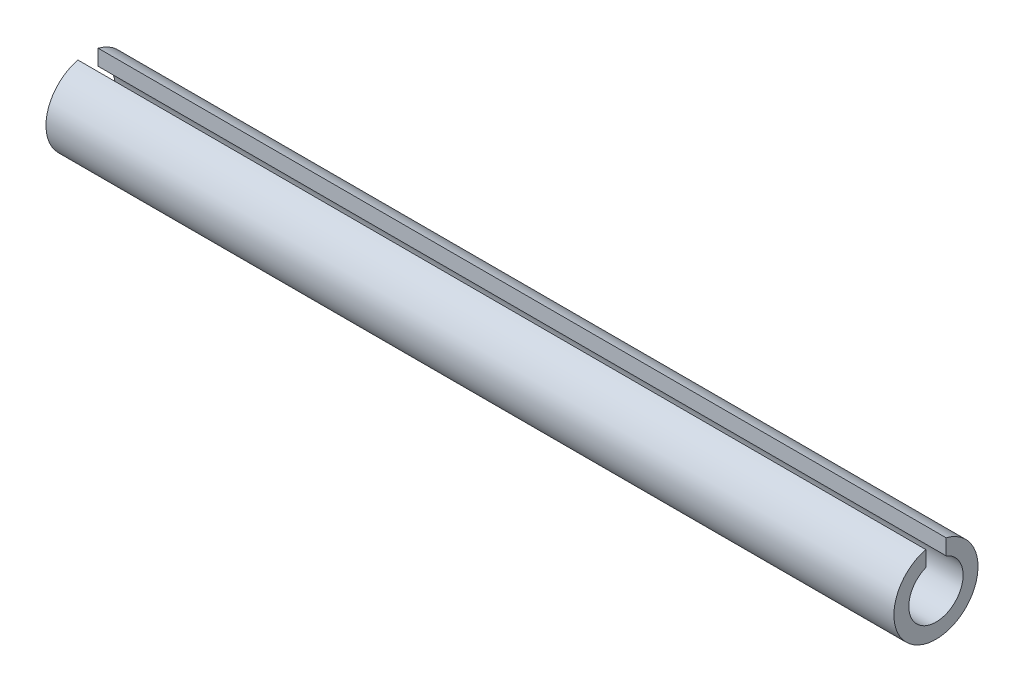
ISO-10303-21;
HEADER;
FILE_DESCRIPTION(('STEP AP214'),'2;1');
FILE_NAME('part.step','',(''),(''),'','','');
FILE_SCHEMA(('AUTOMOTIVE_DESIGN { 1 0 10303 214 1 1 1 1 }'));
ENDSEC;
DATA;
#1=APPLICATION_CONTEXT('core data for automotive mechanical design processes');
#2=APPLICATION_PROTOCOL_DEFINITION('international standard','automotive_design',2000,#1);
#3=PRODUCT_CONTEXT('',#1,'mechanical');
#4=PRODUCT('Part','Part','',(#3));
#5=PRODUCT_RELATED_PRODUCT_CATEGORY('part','',(#4));
#6=PRODUCT_DEFINITION_FORMATION('','',#4);
#7=PRODUCT_DEFINITION_CONTEXT('part definition',#1,'design');
#8=PRODUCT_DEFINITION('design','',#6,#7);
#9=PRODUCT_DEFINITION_SHAPE('','',#8);
#10=(LENGTH_UNIT() NAMED_UNIT(*) SI_UNIT(.MILLI.,.METRE.));
#11=(NAMED_UNIT(*) PLANE_ANGLE_UNIT() SI_UNIT($,.RADIAN.));
#12=(NAMED_UNIT(*) SI_UNIT($,.STERADIAN.) SOLID_ANGLE_UNIT());
#13=UNCERTAINTY_MEASURE_WITH_UNIT(LENGTH_MEASURE(1.E-05),#10,'distance_accuracy_value','');
#14=(GEOMETRIC_REPRESENTATION_CONTEXT(3) GLOBAL_UNCERTAINTY_ASSIGNED_CONTEXT((#13)) GLOBAL_UNIT_ASSIGNED_CONTEXT((#10,
#11,#12)) REPRESENTATION_CONTEXT('',''));
#15=CARTESIAN_POINT('',(0.,0.,0.));
#16=DIRECTION('',(0.,0.,1.));
#17=DIRECTION('',(1.,0.,0.));
#18=AXIS2_PLACEMENT_3D('',#15,#16,#17);
#19=CARTESIAN_POINT('',(15.875,0.,0.));
#20=DIRECTION('',(-1.,0.,0.));
#21=DIRECTION('',(0.,0.,1.));
#22=AXIS2_PLACEMENT_3D('',#19,#20,#21);
#23=CYLINDRICAL_SURFACE('',#22,0.508);
#24=CARTESIAN_POINT('',(0.,0.,0.));
#25=DIRECTION('',(-1.,0.,0.));
#26=DIRECTION('',(0.,0.,-1.));
#27=AXIS2_PLACEMENT_3D('',#24,#25,#26);
#28=CIRCLE('',#27,0.508);
#29=CARTESIAN_POINT('',(0.,0.470928603930575,-0.1905));
#30=VERTEX_POINT('',#29);
#31=CARTESIAN_POINT('',(0.,0.470928603930575,0.1905));
#32=VERTEX_POINT('',#31);
#33=EDGE_CURVE('E95',#30,#32,#28,.T.);
#34=ORIENTED_EDGE('',*,*,#33,.T.);
#35=DIRECTION('',(-1.,0.,0.));
#36=VECTOR('',#35,1.);
#37=CARTESIAN_POINT('',(15.875,0.470928603930575,0.1905));
#38=LINE('',#37,#36);
#39=CARTESIAN_POINT('',(15.875,0.470928603930575,0.1905));
#40=VERTEX_POINT('',#39);
#41=EDGE_CURVE('E11',#40,#32,#38,.T.);
#42=ORIENTED_EDGE('',*,*,#41,.F.);
#43=CARTESIAN_POINT('',(15.875,0.,0.));
#44=DIRECTION('',(-1.,0.,0.));
#45=DIRECTION('',(0.,0.,-1.));
#46=AXIS2_PLACEMENT_3D('',#43,#44,#45);
#47=CIRCLE('',#46,0.508);
#48=CARTESIAN_POINT('',(15.875,0.470928603930575,-0.1905));
#49=VERTEX_POINT('',#48);
#50=EDGE_CURVE('E83',#49,#40,#47,.T.);
#51=ORIENTED_EDGE('',*,*,#50,.F.);
#52=DIRECTION('',(-1.,0.,0.));
#53=VECTOR('',#52,1.);
#54=CARTESIAN_POINT('',(15.875,0.470928603930575,-0.1905));
#55=LINE('',#54,#53);
#56=EDGE_CURVE('E91',#49,#30,#55,.T.);
#57=ORIENTED_EDGE('',*,*,#56,.T.);
#58=EDGE_LOOP('',(#34,#42,#51,#57));
#59=FACE_BOUND('',#58,.T.);
#60=ADVANCED_FACE('F32',(#59),#23,.F.);
#61=CARTESIAN_POINT('',(15.875,0.764008187128908,0.1905));
#62=DIRECTION('',(0.,0.,1.));
#63=DIRECTION('',(0.,-1.,0.));
#64=AXIS2_PLACEMENT_3D('',#61,#62,#63);
#65=PLANE('',#64);
#66=DIRECTION('',(0.,1.,0.));
#67=VECTOR('',#66,1.);
#68=CARTESIAN_POINT('',(0.,0.764008187128908,0.1905));
#69=LINE('',#68,#67);
#70=CARTESIAN_POINT('',(0.,0.764008187128908,0.1905));
#71=VERTEX_POINT('',#70);
#72=EDGE_CURVE('E87',#32,#71,#69,.T.);
#73=ORIENTED_EDGE('',*,*,#72,.T.);
#74=DIRECTION('',(-1.,0.,0.));
#75=VECTOR('',#74,1.);
#76=CARTESIAN_POINT('',(15.875,0.764008187128908,0.1905));
#77=LINE('',#76,#75);
#78=CARTESIAN_POINT('',(15.875,0.764008187128908,0.1905));
#79=VERTEX_POINT('',#78);
#80=EDGE_CURVE('E40',#79,#71,#77,.T.);
#81=ORIENTED_EDGE('',*,*,#80,.F.);
#82=DIRECTION('',(0.,1.,0.));
#83=VECTOR('',#82,1.);
#84=CARTESIAN_POINT('',(15.875,0.764008187128908,0.1905));
#85=LINE('',#84,#83);
#86=EDGE_CURVE('E78',#40,#79,#85,.T.);
#87=ORIENTED_EDGE('',*,*,#86,.F.);
#88=ORIENTED_EDGE('',*,*,#41,.T.);
#89=EDGE_LOOP('',(#73,#81,#87,#88));
#90=FACE_BOUND('',#89,.T.);
#91=ADVANCED_FACE('F86',(#90),#65,.F.);
#92=CARTESIAN_POINT('',(15.875,0.,0.));
#93=DIRECTION('',(-1.,0.,0.));
#94=DIRECTION('',(0.,0.,1.));
#95=AXIS2_PLACEMENT_3D('',#92,#93,#94);
#96=CYLINDRICAL_SURFACE('',#95,0.7874);
#97=CARTESIAN_POINT('',(0.,0.,0.));
#98=DIRECTION('',(1.,0.,0.));
#99=DIRECTION('',(0.,0.,-1.));
#100=AXIS2_PLACEMENT_3D('',#97,#98,#99);
#101=CIRCLE('',#100,0.7874);
#102=CARTESIAN_POINT('',(0.,0.764008187128908,-0.1905));
#103=VERTEX_POINT('',#102);
#104=EDGE_CURVE('E65',#71,#103,#101,.T.);
#105=ORIENTED_EDGE('',*,*,#104,.T.);
#106=DIRECTION('',(-1.,0.,0.));
#107=VECTOR('',#106,1.);
#108=CARTESIAN_POINT('',(15.875,0.764008187128908,-0.1905));
#109=LINE('',#108,#107);
#110=CARTESIAN_POINT('',(15.875,0.764008187128908,-0.1905));
#111=VERTEX_POINT('',#110);
#112=EDGE_CURVE('E88',#111,#103,#109,.T.);
#113=ORIENTED_EDGE('',*,*,#112,.F.);
#114=CARTESIAN_POINT('',(15.875,0.,0.));
#115=DIRECTION('',(1.,0.,0.));
#116=DIRECTION('',(0.,0.,-1.));
#117=AXIS2_PLACEMENT_3D('',#114,#115,#116);
#118=CIRCLE('',#117,0.7874);
#119=EDGE_CURVE('E81',#79,#111,#118,.T.);
#120=ORIENTED_EDGE('',*,*,#119,.F.);
#121=ORIENTED_EDGE('',*,*,#80,.T.);
#122=EDGE_LOOP('',(#105,#113,#120,#121));
#123=FACE_BOUND('',#122,.T.);
#124=ADVANCED_FACE('F89',(#123),#96,.T.);
#125=CARTESIAN_POINT('',(15.875,0.470928603930575,-0.1905));
#126=DIRECTION('',(0.,0.,-1.));
#127=DIRECTION('',(-1.,0.,0.));
#128=AXIS2_PLACEMENT_3D('',#125,#126,#127);
#129=PLANE('',#128);
#130=DIRECTION('',(0.,-1.,0.));
#131=VECTOR('',#130,1.);
#132=CARTESIAN_POINT('',(0.,0.470928603930575,-0.1905));
#133=LINE('',#132,#131);
#134=EDGE_CURVE('E71',#103,#30,#133,.T.);
#135=ORIENTED_EDGE('',*,*,#134,.T.);
#136=ORIENTED_EDGE('',*,*,#56,.F.);
#137=DIRECTION('',(0.,-1.,0.));
#138=VECTOR('',#137,1.);
#139=CARTESIAN_POINT('',(15.875,0.470928603930575,-0.1905));
#140=LINE('',#139,#138);
#141=EDGE_CURVE('E48',#111,#49,#140,.T.);
#142=ORIENTED_EDGE('',*,*,#141,.F.);
#143=ORIENTED_EDGE('',*,*,#112,.T.);
#144=EDGE_LOOP('',(#135,#136,#142,#143));
#145=FACE_BOUND('',#144,.T.);
#146=ADVANCED_FACE('F102',(#145),#129,.F.);
#147=CARTESIAN_POINT('',(15.875,0.,0.));
#148=DIRECTION('',(1.,0.,0.));
#149=DIRECTION('',(0.,0.,-1.));
#150=AXIS2_PLACEMENT_3D('',#147,#148,#149);
#151=PLANE('',#150);
#152=ORIENTED_EDGE('',*,*,#50,.T.);
#153=ORIENTED_EDGE('',*,*,#86,.T.);
#154=ORIENTED_EDGE('',*,*,#119,.T.);
#155=ORIENTED_EDGE('',*,*,#141,.T.);
#156=EDGE_LOOP('',(#152,#153,#154,#155));
#157=FACE_BOUND('',#156,.T.);
#158=ADVANCED_FACE('F79',(#157),#151,.T.);
#159=CARTESIAN_POINT('',(0.,0.,0.));
#160=DIRECTION('',(1.,0.,0.));
#161=DIRECTION('',(0.,0.,-1.));
#162=AXIS2_PLACEMENT_3D('',#159,#160,#161);
#163=PLANE('',#162);
#164=ORIENTED_EDGE('',*,*,#33,.F.);
#165=ORIENTED_EDGE('',*,*,#134,.F.);
#166=ORIENTED_EDGE('',*,*,#104,.F.);
#167=ORIENTED_EDGE('',*,*,#72,.F.);
#168=EDGE_LOOP('',(#164,#165,#166,#167));
#169=FACE_BOUND('',#168,.T.);
#170=ADVANCED_FACE('F105',(#169),#163,.F.);
#171=CLOSED_SHELL('',(#60,#91,#124,#146,#158,#170));
#172=MANIFOLD_SOLID_BREP('B2',#171);
#173=ADVANCED_BREP_SHAPE_REPRESENTATION('',(#18,#172),#14);
#174=SHAPE_DEFINITION_REPRESENTATION(#9,#173);
ENDSEC;
END-ISO-10303-21;
